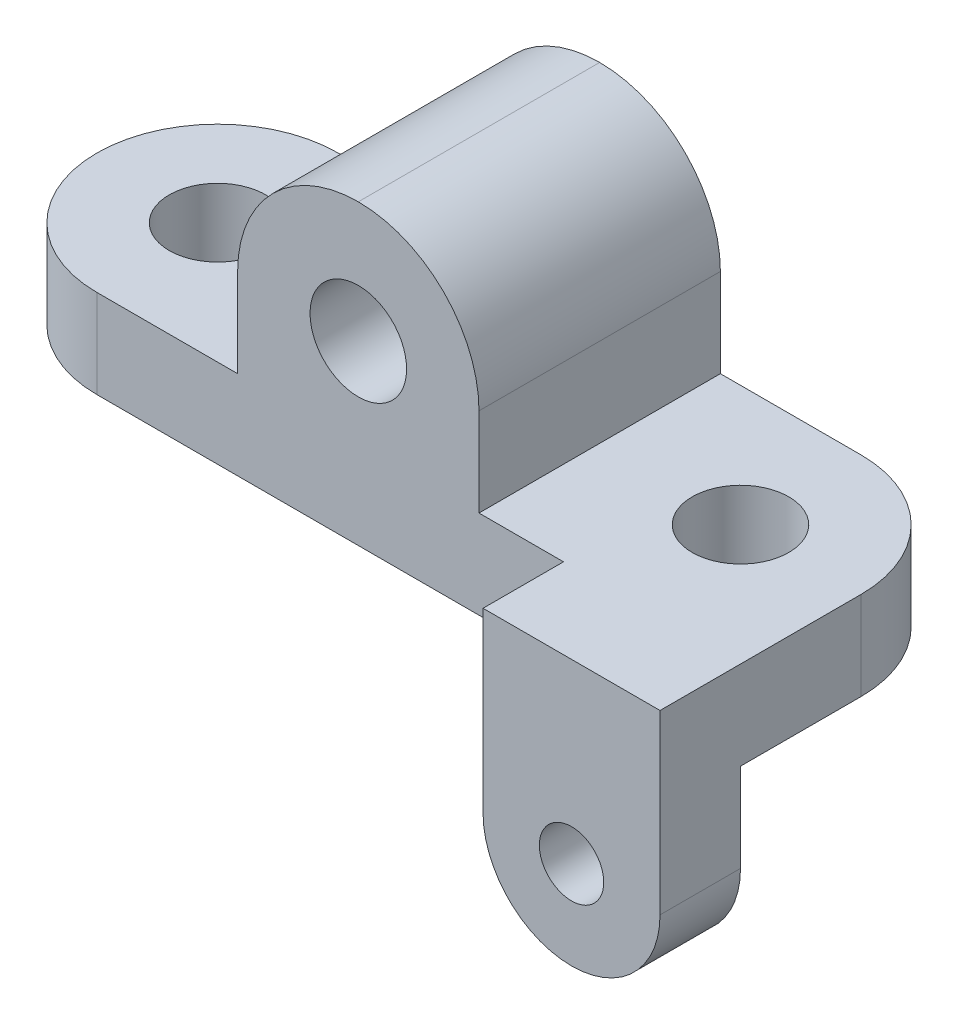
ISO-10303-21;
HEADER;
FILE_DESCRIPTION(('STEP AP214'),'2;1');
FILE_NAME('part.step','',(''),(''),'','','');
FILE_SCHEMA(('AUTOMOTIVE_DESIGN { 1 0 10303 214 1 1 1 1 }'));
ENDSEC;
DATA;
#1=APPLICATION_CONTEXT('core data for automotive mechanical design processes');
#2=APPLICATION_PROTOCOL_DEFINITION('international standard','automotive_design',2000,#1);
#3=PRODUCT_CONTEXT('',#1,'mechanical');
#4=PRODUCT('Part','Part','',(#3));
#5=PRODUCT_RELATED_PRODUCT_CATEGORY('part','',(#4));
#6=PRODUCT_DEFINITION_FORMATION('','',#4);
#7=PRODUCT_DEFINITION_CONTEXT('part definition',#1,'design');
#8=PRODUCT_DEFINITION('design','',#6,#7);
#9=PRODUCT_DEFINITION_SHAPE('','',#8);
#10=(LENGTH_UNIT() NAMED_UNIT(*) SI_UNIT(.MILLI.,.METRE.));
#11=(NAMED_UNIT(*) PLANE_ANGLE_UNIT() SI_UNIT($,.RADIAN.));
#12=(NAMED_UNIT(*) SI_UNIT($,.STERADIAN.) SOLID_ANGLE_UNIT());
#13=UNCERTAINTY_MEASURE_WITH_UNIT(LENGTH_MEASURE(1.E-05),#10,'distance_accuracy_value','');
#14=(GEOMETRIC_REPRESENTATION_CONTEXT(3) GLOBAL_UNCERTAINTY_ASSIGNED_CONTEXT((#13)) GLOBAL_UNIT_ASSIGNED_CONTEXT((#10,
#11,#12)) REPRESENTATION_CONTEXT('',''));
#15=CARTESIAN_POINT('',(0.,0.,0.));
#16=DIRECTION('',(0.,0.,1.));
#17=DIRECTION('',(1.,0.,0.));
#18=AXIS2_PLACEMENT_3D('',#15,#16,#17);
#19=CARTESIAN_POINT('',(0.,22.,-30.));
#20=DIRECTION('',(0.,0.,-1.));
#21=DIRECTION('',(-1.,0.,0.));
#22=AXIS2_PLACEMENT_3D('',#19,#20,#21);
#23=PLANE('',#22);
#24=CARTESIAN_POINT('',(0.,44.,-30.));
#25=DIRECTION('',(0.,0.,1.));
#26=DIRECTION('',(1.,0.,0.));
#27=AXIS2_PLACEMENT_3D('',#24,#25,#26);
#28=CIRCLE('',#27,12.);
#29=CARTESIAN_POINT('',(12.,44.,-30.));
#30=VERTEX_POINT('',#29);
#31=EDGE_CURVE('E319',#30,#30,#28,.T.);
#32=ORIENTED_EDGE('',*,*,#31,.T.);
#33=EDGE_LOOP('',(#32));
#34=FACE_BOUND('',#33,.T.);
#35=DIRECTION('',(0.,-1.,0.));
#36=VECTOR('',#35,1.);
#37=CARTESIAN_POINT('',(-30.,74.,-30.));
#38=LINE('',#37,#36);
#39=CARTESIAN_POINT('',(-30.,44.,-30.));
#40=VERTEX_POINT('',#39);
#41=CARTESIAN_POINT('',(-30.,22.,-30.));
#42=VERTEX_POINT('',#41);
#43=EDGE_CURVE('E224',#40,#42,#38,.T.);
#44=ORIENTED_EDGE('',*,*,#43,.F.);
#45=CARTESIAN_POINT('',(0.,44.,-30.));
#46=DIRECTION('',(0.,0.,-1.));
#47=DIRECTION('',(-1.,0.,0.));
#48=AXIS2_PLACEMENT_3D('',#45,#46,#47);
#49=CIRCLE('',#48,30.);
#50=CARTESIAN_POINT('',(0.,74.,-30.));
#51=VERTEX_POINT('',#50);
#52=EDGE_CURVE('E55',#40,#51,#49,.T.);
#53=ORIENTED_EDGE('',*,*,#52,.T.);
#54=CARTESIAN_POINT('',(0.,44.,-30.));
#55=DIRECTION('',(0.,0.,-1.));
#56=DIRECTION('',(-1.,0.,0.));
#57=AXIS2_PLACEMENT_3D('',#54,#55,#56);
#58=CIRCLE('',#57,30.);
#59=CARTESIAN_POINT('',(30.,44.,-30.));
#60=VERTEX_POINT('',#59);
#61=EDGE_CURVE('E63',#51,#60,#58,.T.);
#62=ORIENTED_EDGE('',*,*,#61,.T.);
#63=DIRECTION('',(0.,-1.,0.));
#64=VECTOR('',#63,1.);
#65=CARTESIAN_POINT('',(30.,74.,-30.));
#66=LINE('',#65,#64);
#67=CARTESIAN_POINT('',(30.,22.,-30.));
#68=VERTEX_POINT('',#67);
#69=EDGE_CURVE('E227',#60,#68,#66,.T.);
#70=ORIENTED_EDGE('',*,*,#69,.T.);
#71=DIRECTION('',(1.,0.,0.));
#72=VECTOR('',#71,1.);
#73=CARTESIAN_POINT('',(0.,22.,-30.));
#74=LINE('',#73,#72);
#75=CARTESIAN_POINT('',(64.9999999999999,22.,-30.));
#76=VERTEX_POINT('',#75);
#77=EDGE_CURVE('E196',#68,#76,#74,.T.);
#78=ORIENTED_EDGE('',*,*,#77,.T.);
#79=DIRECTION('',(0.,-1.,0.));
#80=VECTOR('',#79,1.);
#81=CARTESIAN_POINT('',(64.9999999999999,22.,-30.));
#82=LINE('',#81,#80);
#83=CARTESIAN_POINT('',(64.9999999999999,0.,-30.));
#84=VERTEX_POINT('',#83);
#85=EDGE_CURVE('E202',#76,#84,#82,.T.);
#86=ORIENTED_EDGE('',*,*,#85,.T.);
#87=DIRECTION('',(1.,0.,0.));
#88=VECTOR('',#87,1.);
#89=CARTESIAN_POINT('',(0.,0.,-30.));
#90=LINE('',#89,#88);
#91=CARTESIAN_POINT('',(-65.,0.,-30.));
#92=VERTEX_POINT('',#91);
#93=EDGE_CURVE('E258',#92,#84,#90,.T.);
#94=ORIENTED_EDGE('',*,*,#93,.F.);
#95=DIRECTION('',(0.,-1.,0.));
#96=VECTOR('',#95,1.);
#97=CARTESIAN_POINT('',(-65.,22.,-30.));
#98=LINE('',#97,#96);
#99=CARTESIAN_POINT('',(-65.,22.,-30.));
#100=VERTEX_POINT('',#99);
#101=EDGE_CURVE('E269',#100,#92,#98,.T.);
#102=ORIENTED_EDGE('',*,*,#101,.F.);
#103=DIRECTION('',(1.,0.,0.));
#104=VECTOR('',#103,1.);
#105=CARTESIAN_POINT('',(0.,22.,-30.));
#106=LINE('',#105,#104);
#107=EDGE_CURVE('E238',#100,#42,#106,.T.);
#108=ORIENTED_EDGE('',*,*,#107,.T.);
#109=EDGE_LOOP('',(#44,#53,#62,#70,#78,#86,#94,#102,#108));
#110=FACE_BOUND('',#109,.T.);
#111=ADVANCED_FACE('F45',(#34,#110),#23,.T.);
#112=CARTESIAN_POINT('',(-65.,22.,0.));
#113=DIRECTION('',(0.,-1.,0.));
#114=DIRECTION('',(0.,0.,-1.));
#115=AXIS2_PLACEMENT_3D('',#112,#113,#114);
#116=CYLINDRICAL_SURFACE('',#115,30.);
#117=CARTESIAN_POINT('',(-65.,0.,0.));
#118=DIRECTION('',(0.,1.,0.));
#119=DIRECTION('',(0.,0.,1.));
#120=AXIS2_PLACEMENT_3D('',#117,#118,#119);
#121=CIRCLE('',#120,30.);
#122=CARTESIAN_POINT('',(-65.,0.,30.));
#123=VERTEX_POINT('',#122);
#124=EDGE_CURVE('E261',#92,#123,#121,.T.);
#125=ORIENTED_EDGE('',*,*,#124,.T.);
#126=DIRECTION('',(0.,-1.,0.));
#127=VECTOR('',#126,1.);
#128=CARTESIAN_POINT('',(-65.,22.,30.));
#129=LINE('',#128,#127);
#130=CARTESIAN_POINT('',(-65.,22.,30.));
#131=VERTEX_POINT('',#130);
#132=EDGE_CURVE('E254',#131,#123,#129,.T.);
#133=ORIENTED_EDGE('',*,*,#132,.F.);
#134=CARTESIAN_POINT('',(-65.,22.,0.));
#135=DIRECTION('',(0.,1.,0.));
#136=DIRECTION('',(0.,0.,1.));
#137=AXIS2_PLACEMENT_3D('',#134,#135,#136);
#138=CIRCLE('',#137,30.);
#139=EDGE_CURVE('E242',#100,#131,#138,.T.);
#140=ORIENTED_EDGE('',*,*,#139,.F.);
#141=ORIENTED_EDGE('',*,*,#101,.T.);
#142=EDGE_LOOP('',(#125,#133,#140,#141));
#143=FACE_BOUND('',#142,.T.);
#144=ADVANCED_FACE('F382',(#143),#116,.T.);
#145=CARTESIAN_POINT('',(0.,22.,30.));
#146=DIRECTION('',(0.,0.,-1.));
#147=DIRECTION('',(-1.,0.,0.));
#148=AXIS2_PLACEMENT_3D('',#145,#146,#147);
#149=PLANE('',#148);
#150=CARTESIAN_POINT('',(0.,44.,30.));
#151=DIRECTION('',(0.,0.,-1.));
#152=DIRECTION('',(-1.,0.,0.));
#153=AXIS2_PLACEMENT_3D('',#150,#151,#152);
#154=CIRCLE('',#153,12.);
#155=CARTESIAN_POINT('',(-12.,44.,30.));
#156=VERTEX_POINT('',#155);
#157=EDGE_CURVE('E49',#156,#156,#154,.T.);
#158=ORIENTED_EDGE('',*,*,#157,.T.);
#159=EDGE_LOOP('',(#158));
#160=FACE_BOUND('',#159,.T.);
#161=CARTESIAN_POINT('',(0.,44.,30.));
#162=DIRECTION('',(0.,0.,-1.));
#163=DIRECTION('',(-1.,0.,0.));
#164=AXIS2_PLACEMENT_3D('',#161,#162,#163);
#165=CIRCLE('',#164,30.);
#166=CARTESIAN_POINT('',(30.,44.,30.0000000000001));
#167=VERTEX_POINT('',#166);
#168=CARTESIAN_POINT('',(0.,74.,30.));
#169=VERTEX_POINT('',#168);
#170=EDGE_CURVE('E290',#167,#169,#165,.F.);
#171=ORIENTED_EDGE('',*,*,#170,.T.);
#172=CARTESIAN_POINT('',(0.,44.,30.));
#173=DIRECTION('',(0.,0.,-1.));
#174=DIRECTION('',(-1.,0.,0.));
#175=AXIS2_PLACEMENT_3D('',#172,#173,#174);
#176=CIRCLE('',#175,30.);
#177=CARTESIAN_POINT('',(-30.,44.,30.));
#178=VERTEX_POINT('',#177);
#179=EDGE_CURVE('E293',#169,#178,#176,.F.);
#180=ORIENTED_EDGE('',*,*,#179,.T.);
#181=DIRECTION('',(0.,-1.,0.));
#182=VECTOR('',#181,1.);
#183=CARTESIAN_POINT('',(-30.,74.,30.));
#184=LINE('',#183,#182);
#185=CARTESIAN_POINT('',(-30.,22.,30.));
#186=VERTEX_POINT('',#185);
#187=EDGE_CURVE('E221',#178,#186,#184,.T.);
#188=ORIENTED_EDGE('',*,*,#187,.T.);
#189=DIRECTION('',(1.,0.,0.));
#190=VECTOR('',#189,1.);
#191=CARTESIAN_POINT('',(0.,22.,30.));
#192=LINE('',#191,#190);
#193=EDGE_CURVE('E246',#131,#186,#192,.T.);
#194=ORIENTED_EDGE('',*,*,#193,.F.);
#195=ORIENTED_EDGE('',*,*,#132,.T.);
#196=DIRECTION('',(1.,0.,0.));
#197=VECTOR('',#196,1.);
#198=CARTESIAN_POINT('',(0.,0.,30.));
#199=LINE('',#198,#197);
#200=CARTESIAN_POINT('',(51.,0.,30.0000000000001));
#201=VERTEX_POINT('',#200);
#202=EDGE_CURVE('E173',#123,#201,#199,.T.);
#203=ORIENTED_EDGE('',*,*,#202,.T.);
#204=DIRECTION('',(0.,1.,0.));
#205=VECTOR('',#204,1.);
#206=CARTESIAN_POINT('',(51.,-44.,30.0000000000001));
#207=LINE('',#206,#205);
#208=CARTESIAN_POINT('',(51.,22.,30.0000000000001));
#209=VERTEX_POINT('',#208);
#210=EDGE_CURVE('E152',#201,#209,#207,.T.);
#211=ORIENTED_EDGE('',*,*,#210,.T.);
#212=DIRECTION('',(1.,0.,0.));
#213=VECTOR('',#212,1.);
#214=CARTESIAN_POINT('',(0.,22.,30.));
#215=LINE('',#214,#213);
#216=CARTESIAN_POINT('',(30.,22.,30.0000000000001));
#217=VERTEX_POINT('',#216);
#218=EDGE_CURVE('E170',#217,#209,#215,.T.);
#219=ORIENTED_EDGE('',*,*,#218,.F.);
#220=DIRECTION('',(0.,-1.,0.));
#221=VECTOR('',#220,1.);
#222=CARTESIAN_POINT('',(30.,74.,30.0000000000001));
#223=LINE('',#222,#221);
#224=EDGE_CURVE('E230',#167,#217,#223,.T.);
#225=ORIENTED_EDGE('',*,*,#224,.F.);
#226=EDGE_LOOP('',(#171,#180,#188,#194,#195,#203,#211,#219,#225));
#227=FACE_BOUND('',#226,.T.);
#228=ADVANCED_FACE('F168',(#160,#227),#149,.F.);
#229=CARTESIAN_POINT('',(-65.,22.,0.));
#230=DIRECTION('',(0.,-1.,0.));
#231=DIRECTION('',(0.,0.,-1.));
#232=AXIS2_PLACEMENT_3D('',#229,#230,#231);
#233=CYLINDRICAL_SURFACE('',#232,12.);
#234=CARTESIAN_POINT('',(-65.,22.,0.));
#235=DIRECTION('',(0.,1.,0.));
#236=DIRECTION('',(0.,0.,1.));
#237=AXIS2_PLACEMENT_3D('',#234,#235,#236);
#238=CIRCLE('',#237,12.);
#239=CARTESIAN_POINT('',(-65.,22.,12.));
#240=VERTEX_POINT('',#239);
#241=EDGE_CURVE('E234',#240,#240,#238,.T.);
#242=ORIENTED_EDGE('',*,*,#241,.T.);
#243=EDGE_LOOP('',(#242));
#244=FACE_BOUND('',#243,.T.);
#245=CARTESIAN_POINT('',(-65.,0.,0.));
#246=DIRECTION('',(0.,1.,0.));
#247=DIRECTION('',(0.,0.,1.));
#248=AXIS2_PLACEMENT_3D('',#245,#246,#247);
#249=CIRCLE('',#248,12.);
#250=CARTESIAN_POINT('',(-65.,0.,12.));
#251=VERTEX_POINT('',#250);
#252=EDGE_CURVE('E233',#251,#251,#249,.T.);
#253=ORIENTED_EDGE('',*,*,#252,.F.);
#254=EDGE_LOOP('',(#253));
#255=FACE_BOUND('',#254,.T.);
#256=ADVANCED_FACE('F392',(#244,#255),#233,.F.);
#257=CARTESIAN_POINT('',(0.,22.,0.));
#258=DIRECTION('',(0.,1.,0.));
#259=DIRECTION('',(0.,0.,1.));
#260=AXIS2_PLACEMENT_3D('',#257,#258,#259);
#261=PLANE('',#260);
#262=ORIENTED_EDGE('',*,*,#241,.F.);
#263=EDGE_LOOP('',(#262));
#264=FACE_BOUND('',#263,.T.);
#265=ORIENTED_EDGE('',*,*,#107,.F.);
#266=ORIENTED_EDGE('',*,*,#139,.T.);
#267=ORIENTED_EDGE('',*,*,#193,.T.);
#268=DIRECTION('',(0.,0.,1.));
#269=VECTOR('',#268,1.);
#270=CARTESIAN_POINT('',(-30.,22.,0.));
#271=LINE('',#270,#269);
#272=EDGE_CURVE('E250',#42,#186,#271,.T.);
#273=ORIENTED_EDGE('',*,*,#272,.F.);
#274=EDGE_LOOP('',(#265,#266,#267,#273));
#275=FACE_BOUND('',#274,.T.);
#276=ADVANCED_FACE('F395',(#264,#275),#261,.T.);
#277=CARTESIAN_POINT('',(0.,0.,0.));
#278=DIRECTION('',(0.,1.,0.));
#279=DIRECTION('',(0.,0.,1.));
#280=AXIS2_PLACEMENT_3D('',#277,#278,#279);
#281=PLANE('',#280);
#282=ORIENTED_EDGE('',*,*,#252,.T.);
#283=EDGE_LOOP('',(#282));
#284=FACE_BOUND('',#283,.T.);
#285=ORIENTED_EDGE('',*,*,#93,.T.);
#286=CARTESIAN_POINT('',(64.9999999999999,0.,0.));
#287=DIRECTION('',(0.,1.,0.));
#288=DIRECTION('',(0.,0.,1.));
#289=AXIS2_PLACEMENT_3D('',#286,#287,#288);
#290=CIRCLE('',#289,30.);
#291=CARTESIAN_POINT('',(95.,0.,0.));
#292=VERTEX_POINT('',#291);
#293=EDGE_CURVE('E190',#292,#84,#290,.T.);
#294=ORIENTED_EDGE('',*,*,#293,.F.);
#295=DIRECTION('',(0.,0.,-1.));
#296=VECTOR('',#295,1.);
#297=CARTESIAN_POINT('',(95.,0.,0.));
#298=LINE('',#297,#296);
#299=CARTESIAN_POINT('',(95.,0.,30.));
#300=VERTEX_POINT('',#299);
#301=EDGE_CURVE('E207',#300,#292,#298,.T.);
#302=ORIENTED_EDGE('',*,*,#301,.F.);
#303=DIRECTION('',(1.,0.,0.));
#304=VECTOR('',#303,1.);
#305=CARTESIAN_POINT('',(0.,0.,30.0000000000002));
#306=LINE('',#305,#304);
#307=EDGE_CURVE('E208',#201,#300,#306,.T.);
#308=ORIENTED_EDGE('',*,*,#307,.F.);
#309=ORIENTED_EDGE('',*,*,#202,.F.);
#310=ORIENTED_EDGE('',*,*,#124,.F.);
#311=EDGE_LOOP('',(#285,#294,#302,#308,#309,#310));
#312=FACE_BOUND('',#311,.T.);
#313=CARTESIAN_POINT('',(64.9999999999999,0.,0.));
#314=DIRECTION('',(0.,1.,0.));
#315=DIRECTION('',(0.,0.,1.));
#316=AXIS2_PLACEMENT_3D('',#313,#314,#315);
#317=CIRCLE('',#316,12.);
#318=CARTESIAN_POINT('',(64.9999999999999,0.,12.));
#319=VERTEX_POINT('',#318);
#320=EDGE_CURVE('E203',#319,#319,#317,.T.);
#321=ORIENTED_EDGE('',*,*,#320,.T.);
#322=EDGE_LOOP('',(#321));
#323=FACE_BOUND('',#322,.T.);
#324=ADVANCED_FACE('F348',(#284,#312,#323),#281,.F.);
#325=CARTESIAN_POINT('',(-30.,74.,0.));
#326=DIRECTION('',(1.,0.,0.));
#327=DIRECTION('',(0.,0.,-1.));
#328=AXIS2_PLACEMENT_3D('',#325,#326,#327);
#329=PLANE('',#328);
#330=ORIENTED_EDGE('',*,*,#187,.F.);
#331=DIRECTION('',(0.,0.,1.));
#332=VECTOR('',#331,1.);
#333=CARTESIAN_POINT('',(-30.,44.,-30.));
#334=LINE('',#333,#332);
#335=EDGE_CURVE('E296',#178,#40,#334,.F.);
#336=ORIENTED_EDGE('',*,*,#335,.T.);
#337=ORIENTED_EDGE('',*,*,#43,.T.);
#338=ORIENTED_EDGE('',*,*,#272,.T.);
#339=EDGE_LOOP('',(#330,#336,#337,#338));
#340=FACE_BOUND('',#339,.T.);
#341=ADVANCED_FACE('F413',(#340),#329,.F.);
#342=CARTESIAN_POINT('',(30.,74.,0.));
#343=DIRECTION('',(-1.,0.,0.));
#344=DIRECTION('',(0.,0.,1.));
#345=AXIS2_PLACEMENT_3D('',#342,#343,#344);
#346=PLANE('',#345);
#347=ORIENTED_EDGE('',*,*,#69,.F.);
#348=DIRECTION('',(0.,0.,-1.));
#349=VECTOR('',#348,1.);
#350=CARTESIAN_POINT('',(30.,44.,30.0000000000001));
#351=LINE('',#350,#349);
#352=EDGE_CURVE('E12',#60,#167,#351,.F.);
#353=ORIENTED_EDGE('',*,*,#352,.T.);
#354=ORIENTED_EDGE('',*,*,#224,.T.);
#355=DIRECTION('',(0.,0.,-1.));
#356=VECTOR('',#355,1.);
#357=CARTESIAN_POINT('',(30.,22.,0.));
#358=LINE('',#357,#356);
#359=EDGE_CURVE('E180',#217,#68,#358,.T.);
#360=ORIENTED_EDGE('',*,*,#359,.T.);
#361=EDGE_LOOP('',(#347,#353,#354,#360));
#362=FACE_BOUND('',#361,.T.);
#363=ADVANCED_FACE('F423',(#362),#346,.F.);
#364=CARTESIAN_POINT('',(95.,22.,0.));
#365=DIRECTION('',(-1.,0.,0.));
#366=DIRECTION('',(0.,0.,1.));
#367=AXIS2_PLACEMENT_3D('',#364,#365,#366);
#368=PLANE('',#367);
#369=DIRECTION('',(0.,1.,0.));
#370=VECTOR('',#369,1.);
#371=CARTESIAN_POINT('',(94.9999999999999,-44.,50.));
#372=LINE('',#371,#370);
#373=CARTESIAN_POINT('',(94.9999999999999,-22.,50.));
#374=VERTEX_POINT('',#373);
#375=CARTESIAN_POINT('',(94.9999999999999,22.,50.));
#376=VERTEX_POINT('',#375);
#377=EDGE_CURVE('E334',#374,#376,#372,.T.);
#378=ORIENTED_EDGE('',*,*,#377,.F.);
#379=DIRECTION('',(0.,0.,1.));
#380=VECTOR('',#379,1.);
#381=CARTESIAN_POINT('',(95.,-22.,0.));
#382=LINE('',#381,#380);
#383=CARTESIAN_POINT('',(95.,-22.,30.));
#384=VERTEX_POINT('',#383);
#385=EDGE_CURVE('E287',#374,#384,#382,.F.);
#386=ORIENTED_EDGE('',*,*,#385,.T.);
#387=DIRECTION('',(0.,1.,0.));
#388=VECTOR('',#387,1.);
#389=CARTESIAN_POINT('',(95.,-44.,30.));
#390=LINE('',#389,#388);
#391=EDGE_CURVE('E331',#384,#300,#390,.T.);
#392=ORIENTED_EDGE('',*,*,#391,.T.);
#393=ORIENTED_EDGE('',*,*,#301,.T.);
#394=DIRECTION('',(0.,-1.,0.));
#395=VECTOR('',#394,1.);
#396=CARTESIAN_POINT('',(95.,22.,0.));
#397=LINE('',#396,#395);
#398=CARTESIAN_POINT('',(95.,22.,0.));
#399=VERTEX_POINT('',#398);
#400=EDGE_CURVE('E217',#399,#292,#397,.T.);
#401=ORIENTED_EDGE('',*,*,#400,.F.);
#402=DIRECTION('',(0.,0.,-1.));
#403=VECTOR('',#402,1.);
#404=CARTESIAN_POINT('',(95.,22.,0.));
#405=LINE('',#404,#403);
#406=EDGE_CURVE('E182',#376,#399,#405,.T.);
#407=ORIENTED_EDGE('',*,*,#406,.F.);
#408=EDGE_LOOP('',(#378,#386,#392,#393,#401,#407));
#409=FACE_BOUND('',#408,.T.);
#410=ADVANCED_FACE('F353',(#409),#368,.F.);
#411=CARTESIAN_POINT('',(64.9999999999999,22.,0.));
#412=DIRECTION('',(0.,-1.,0.));
#413=DIRECTION('',(0.,0.,-1.));
#414=AXIS2_PLACEMENT_3D('',#411,#412,#413);
#415=CYLINDRICAL_SURFACE('',#414,30.);
#416=ORIENTED_EDGE('',*,*,#293,.T.);
#417=ORIENTED_EDGE('',*,*,#85,.F.);
#418=CARTESIAN_POINT('',(64.9999999999999,22.,0.));
#419=DIRECTION('',(0.,1.,0.));
#420=DIRECTION('',(0.,0.,1.));
#421=AXIS2_PLACEMENT_3D('',#418,#419,#420);
#422=CIRCLE('',#421,30.);
#423=EDGE_CURVE('E187',#399,#76,#422,.T.);
#424=ORIENTED_EDGE('',*,*,#423,.F.);
#425=ORIENTED_EDGE('',*,*,#400,.T.);
#426=EDGE_LOOP('',(#416,#417,#424,#425));
#427=FACE_BOUND('',#426,.T.);
#428=ADVANCED_FACE('F357',(#427),#415,.T.);
#429=CARTESIAN_POINT('',(64.9999999999999,22.,0.));
#430=DIRECTION('',(0.,-1.,0.));
#431=DIRECTION('',(0.,0.,-1.));
#432=AXIS2_PLACEMENT_3D('',#429,#430,#431);
#433=CYLINDRICAL_SURFACE('',#432,12.);
#434=CARTESIAN_POINT('',(64.9999999999999,22.,0.));
#435=DIRECTION('',(0.,1.,0.));
#436=DIRECTION('',(0.,0.,1.));
#437=AXIS2_PLACEMENT_3D('',#434,#435,#436);
#438=CIRCLE('',#437,12.);
#439=CARTESIAN_POINT('',(64.9999999999999,22.,12.));
#440=VERTEX_POINT('',#439);
#441=EDGE_CURVE('E183',#440,#440,#438,.T.);
#442=ORIENTED_EDGE('',*,*,#441,.T.);
#443=EDGE_LOOP('',(#442));
#444=FACE_BOUND('',#443,.T.);
#445=ORIENTED_EDGE('',*,*,#320,.F.);
#446=EDGE_LOOP('',(#445));
#447=FACE_BOUND('',#446,.T.);
#448=ADVANCED_FACE('F553',(#444,#447),#433,.F.);
#449=CARTESIAN_POINT('',(0.,22.,0.));
#450=DIRECTION('',(0.,1.,0.));
#451=DIRECTION('',(0.,0.,1.));
#452=AXIS2_PLACEMENT_3D('',#449,#450,#451);
#453=PLANE('',#452);
#454=ORIENTED_EDGE('',*,*,#441,.F.);
#455=EDGE_LOOP('',(#454));
#456=FACE_BOUND('',#455,.T.);
#457=ORIENTED_EDGE('',*,*,#218,.T.);
#458=DIRECTION('',(0.,0.,1.));
#459=VECTOR('',#458,1.);
#460=CARTESIAN_POINT('',(50.9999999999999,22.,0.));
#461=LINE('',#460,#459);
#462=CARTESIAN_POINT('',(51.,22.,50.0000000000001));
#463=VERTEX_POINT('',#462);
#464=EDGE_CURVE('E148',#209,#463,#461,.T.);
#465=ORIENTED_EDGE('',*,*,#464,.T.);
#466=DIRECTION('',(1.,0.,0.));
#467=VECTOR('',#466,1.);
#468=CARTESIAN_POINT('',(1.26161707343769E-13,22.,50.0000000000003));
#469=LINE('',#468,#467);
#470=EDGE_CURVE('E162',#463,#376,#469,.T.);
#471=ORIENTED_EDGE('',*,*,#470,.T.);
#472=ORIENTED_EDGE('',*,*,#406,.T.);
#473=ORIENTED_EDGE('',*,*,#423,.T.);
#474=ORIENTED_EDGE('',*,*,#77,.F.);
#475=ORIENTED_EDGE('',*,*,#359,.F.);
#476=EDGE_LOOP('',(#457,#465,#471,#472,#473,#474,#475));
#477=FACE_BOUND('',#476,.T.);
#478=ADVANCED_FACE('F177',(#456,#477),#453,.T.);
#479=CARTESIAN_POINT('',(0.,-44.,30.0000000000002));
#480=DIRECTION('',(0.,0.,1.));
#481=DIRECTION('',(1.,0.,0.));
#482=AXIS2_PLACEMENT_3D('',#479,#480,#481);
#483=PLANE('',#482);
#484=CARTESIAN_POINT('',(72.9999999999999,-22.,30.));
#485=DIRECTION('',(0.,0.,1.));
#486=DIRECTION('',(1.,0.,0.));
#487=AXIS2_PLACEMENT_3D('',#484,#485,#486);
#488=CIRCLE('',#487,8.00000000000001);
#489=CARTESIAN_POINT('',(80.9999999999999,-22.,30.));
#490=VERTEX_POINT('',#489);
#491=EDGE_CURVE('E314',#490,#490,#488,.T.);
#492=ORIENTED_EDGE('',*,*,#491,.T.);
#493=EDGE_LOOP('',(#492));
#494=FACE_BOUND('',#493,.T.);
#495=CARTESIAN_POINT('',(73.,-22.,30.));
#496=DIRECTION('',(0.,0.,1.));
#497=DIRECTION('',(1.,0.,0.));
#498=AXIS2_PLACEMENT_3D('',#495,#496,#497);
#499=CIRCLE('',#498,22.);
#500=CARTESIAN_POINT('',(73.,-44.,30.));
#501=VERTEX_POINT('',#500);
#502=EDGE_CURVE('E281',#384,#501,#499,.F.);
#503=ORIENTED_EDGE('',*,*,#502,.T.);
#504=CARTESIAN_POINT('',(73.,-22.,30.));
#505=DIRECTION('',(0.,0.,1.));
#506=DIRECTION('',(1.,0.,0.));
#507=AXIS2_PLACEMENT_3D('',#504,#505,#506);
#508=CIRCLE('',#507,22.);
#509=CARTESIAN_POINT('',(51.,-22.,30.0000000000001));
#510=VERTEX_POINT('',#509);
#511=EDGE_CURVE('E284',#501,#510,#508,.F.);
#512=ORIENTED_EDGE('',*,*,#511,.T.);
#513=EDGE_CURVE('E175',#510,#201,#207,.T.);
#514=ORIENTED_EDGE('',*,*,#513,.T.);
#515=ORIENTED_EDGE('',*,*,#307,.T.);
#516=ORIENTED_EDGE('',*,*,#391,.F.);
#517=EDGE_LOOP('',(#503,#512,#514,#515,#516));
#518=FACE_BOUND('',#517,.T.);
#519=ADVANCED_FACE('F344',(#494,#518),#483,.F.);
#520=CARTESIAN_POINT('',(1.26161707343769E-13,-44.,50.0000000000003));
#521=DIRECTION('',(0.,0.,1.));
#522=DIRECTION('',(1.,0.,0.));
#523=AXIS2_PLACEMENT_3D('',#520,#521,#522);
#524=PLANE('',#523);
#525=CARTESIAN_POINT('',(72.9999999999999,-22.,50.0000000000001));
#526=DIRECTION('',(0.,0.,1.));
#527=DIRECTION('',(1.,0.,0.));
#528=AXIS2_PLACEMENT_3D('',#525,#526,#527);
#529=CIRCLE('',#528,8.00000000000001);
#530=CARTESIAN_POINT('',(80.9999999999999,-22.,50.0000000000001));
#531=VERTEX_POINT('',#530);
#532=EDGE_CURVE('E325',#531,#531,#529,.T.);
#533=ORIENTED_EDGE('',*,*,#532,.F.);
#534=EDGE_LOOP('',(#533));
#535=FACE_BOUND('',#534,.T.);
#536=DIRECTION('',(0.,1.,0.));
#537=VECTOR('',#536,1.);
#538=CARTESIAN_POINT('',(51.,-44.,50.0000000000001));
#539=LINE('',#538,#537);
#540=CARTESIAN_POINT('',(51.,-22.,50.0000000000001));
#541=VERTEX_POINT('',#540);
#542=EDGE_CURVE('E156',#541,#463,#539,.T.);
#543=ORIENTED_EDGE('',*,*,#542,.F.);
#544=CARTESIAN_POINT('',(73.,-22.,50.0000000000001));
#545=DIRECTION('',(0.,0.,1.));
#546=DIRECTION('',(1.,0.,0.));
#547=AXIS2_PLACEMENT_3D('',#544,#545,#546);
#548=CIRCLE('',#547,22.);
#549=CARTESIAN_POINT('',(73.,-44.,50.0000000000001));
#550=VERTEX_POINT('',#549);
#551=EDGE_CURVE('E278',#541,#550,#548,.T.);
#552=ORIENTED_EDGE('',*,*,#551,.T.);
#553=CARTESIAN_POINT('',(73.,-22.,50.0000000000001));
#554=DIRECTION('',(0.,0.,1.));
#555=DIRECTION('',(1.,0.,0.));
#556=AXIS2_PLACEMENT_3D('',#553,#554,#555);
#557=CIRCLE('',#556,22.);
#558=EDGE_CURVE('E275',#550,#374,#557,.T.);
#559=ORIENTED_EDGE('',*,*,#558,.T.);
#560=ORIENTED_EDGE('',*,*,#377,.T.);
#561=ORIENTED_EDGE('',*,*,#470,.F.);
#562=EDGE_LOOP('',(#543,#552,#559,#560,#561));
#563=FACE_BOUND('',#562,.T.);
#564=ADVANCED_FACE('F369',(#535,#563),#524,.T.);
#565=CARTESIAN_POINT('',(50.9999999999999,-44.,0.));
#566=DIRECTION('',(-1.,0.,0.));
#567=DIRECTION('',(0.,0.,1.));
#568=AXIS2_PLACEMENT_3D('',#565,#566,#567);
#569=PLANE('',#568);
#570=ORIENTED_EDGE('',*,*,#513,.F.);
#571=DIRECTION('',(0.,0.,1.));
#572=VECTOR('',#571,1.);
#573=CARTESIAN_POINT('',(51.,-22.,50.0000000000001));
#574=LINE('',#573,#572);
#575=EDGE_CURVE('E272',#510,#541,#574,.T.);
#576=ORIENTED_EDGE('',*,*,#575,.T.);
#577=ORIENTED_EDGE('',*,*,#542,.T.);
#578=ORIENTED_EDGE('',*,*,#464,.F.);
#579=ORIENTED_EDGE('',*,*,#210,.F.);
#580=EDGE_LOOP('',(#570,#576,#577,#578,#579));
#581=FACE_BOUND('',#580,.T.);
#582=ADVANCED_FACE('F151',(#581),#569,.T.);
#583=CARTESIAN_POINT('',(73.,-22.,0.));
#584=DIRECTION('',(0.,0.,1.));
#585=DIRECTION('',(1.,0.,0.));
#586=AXIS2_PLACEMENT_3D('',#583,#584,#585);
#587=CYLINDRICAL_SURFACE('',#586,22.);
#588=DIRECTION('',(0.,0.,1.));
#589=VECTOR('',#588,1.);
#590=CARTESIAN_POINT('',(73.,-44.,0.));
#591=LINE('',#590,#589);
#592=EDGE_CURVE('E163',#501,#550,#591,.T.);
#593=ORIENTED_EDGE('',*,*,#592,.F.);
#594=ORIENTED_EDGE('',*,*,#502,.F.);
#595=ORIENTED_EDGE('',*,*,#385,.F.);
#596=ORIENTED_EDGE('',*,*,#558,.F.);
#597=EDGE_LOOP('',(#593,#594,#595,#596));
#598=FACE_BOUND('',#597,.T.);
#599=ADVANCED_FACE('F364',(#598),#587,.T.);
#600=CARTESIAN_POINT('',(72.9999999999999,-22.,0.));
#601=DIRECTION('',(0.,0.,-1.));
#602=DIRECTION('',(-1.,0.,0.));
#603=AXIS2_PLACEMENT_3D('',#600,#601,#602);
#604=CYLINDRICAL_SURFACE('',#603,22.);
#605=ORIENTED_EDGE('',*,*,#511,.F.);
#606=ORIENTED_EDGE('',*,*,#592,.T.);
#607=ORIENTED_EDGE('',*,*,#551,.F.);
#608=ORIENTED_EDGE('',*,*,#575,.F.);
#609=EDGE_LOOP('',(#605,#606,#607,#608));
#610=FACE_BOUND('',#609,.T.);
#611=ADVANCED_FACE('F368',(#610),#604,.T.);
#612=CARTESIAN_POINT('',(0.,44.,0.));
#613=DIRECTION('',(0.,0.,1.));
#614=DIRECTION('',(1.,0.,0.));
#615=AXIS2_PLACEMENT_3D('',#612,#613,#614);
#616=CYLINDRICAL_SURFACE('',#615,30.);
#617=ORIENTED_EDGE('',*,*,#352,.F.);
#618=ORIENTED_EDGE('',*,*,#61,.F.);
#619=DIRECTION('',(0.,0.,-1.));
#620=VECTOR('',#619,1.);
#621=CARTESIAN_POINT('',(0.,74.,-30.));
#622=LINE('',#621,#620);
#623=EDGE_CURVE('E306',#169,#51,#622,.T.);
#624=ORIENTED_EDGE('',*,*,#623,.F.);
#625=ORIENTED_EDGE('',*,*,#170,.F.);
#626=EDGE_LOOP('',(#617,#618,#624,#625));
#627=FACE_BOUND('',#626,.T.);
#628=ADVANCED_FACE('F47',(#627),#616,.T.);
#629=CARTESIAN_POINT('',(0.,44.,0.));
#630=DIRECTION('',(0.,0.,-1.));
#631=DIRECTION('',(-1.,0.,0.));
#632=AXIS2_PLACEMENT_3D('',#629,#630,#631);
#633=CYLINDRICAL_SURFACE('',#632,30.);
#634=ORIENTED_EDGE('',*,*,#52,.F.);
#635=ORIENTED_EDGE('',*,*,#335,.F.);
#636=ORIENTED_EDGE('',*,*,#179,.F.);
#637=ORIENTED_EDGE('',*,*,#623,.T.);
#638=EDGE_LOOP('',(#634,#635,#636,#637));
#639=FACE_BOUND('',#638,.T.);
#640=ADVANCED_FACE('F400',(#639),#633,.T.);
#641=CARTESIAN_POINT('',(72.9999999999999,-22.,-30.));
#642=DIRECTION('',(0.,0.,1.));
#643=DIRECTION('',(1.,0.,0.));
#644=AXIS2_PLACEMENT_3D('',#641,#642,#643);
#645=CYLINDRICAL_SURFACE('',#644,8.00000000000001);
#646=ORIENTED_EDGE('',*,*,#532,.T.);
#647=EDGE_LOOP('',(#646));
#648=FACE_BOUND('',#647,.T.);
#649=ORIENTED_EDGE('',*,*,#491,.F.);
#650=EDGE_LOOP('',(#649));
#651=FACE_BOUND('',#650,.T.);
#652=ADVANCED_FACE('F402',(#648,#651),#645,.F.);
#653=CARTESIAN_POINT('',(0.,44.,-30.));
#654=DIRECTION('',(0.,0.,1.));
#655=DIRECTION('',(1.,0.,0.));
#656=AXIS2_PLACEMENT_3D('',#653,#654,#655);
#657=CYLINDRICAL_SURFACE('',#656,12.);
#658=ORIENTED_EDGE('',*,*,#31,.F.);
#659=EDGE_LOOP('',(#658));
#660=FACE_BOUND('',#659,.T.);
#661=ORIENTED_EDGE('',*,*,#157,.F.);
#662=EDGE_LOOP('',(#661));
#663=FACE_BOUND('',#662,.T.);
#664=ADVANCED_FACE('F407',(#660,#663),#657,.F.);
#665=CLOSED_SHELL('',(#111,#144,#228,#256,#276,#324,#341,#363,#410,#428,#448,#478,#519,#564,
#582,#599,#611,#628,#640,#652,#664));
#666=MANIFOLD_SOLID_BREP('B2',#665);
#667=ADVANCED_BREP_SHAPE_REPRESENTATION('',(#18,#666),#14);
#668=SHAPE_DEFINITION_REPRESENTATION(#9,#667);
ENDSEC;
END-ISO-10303-21;
